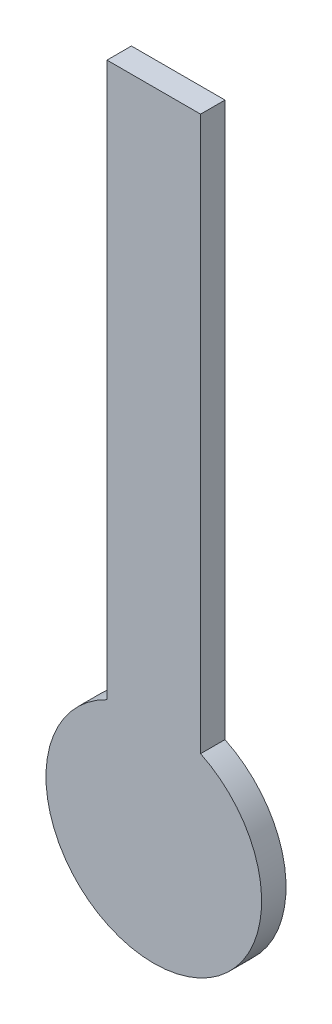
ISO-10303-21;
HEADER;
FILE_DESCRIPTION(('STEP AP214'),'2;1');
FILE_NAME('part.step','',(''),(''),'','','');
FILE_SCHEMA(('AUTOMOTIVE_DESIGN { 1 0 10303 214 1 1 1 1 }'));
ENDSEC;
DATA;
#1=APPLICATION_CONTEXT('core data for automotive mechanical design processes');
#2=APPLICATION_PROTOCOL_DEFINITION('international standard','automotive_design',2000,#1);
#3=PRODUCT_CONTEXT('',#1,'mechanical');
#4=PRODUCT('Part','Part','',(#3));
#5=PRODUCT_RELATED_PRODUCT_CATEGORY('part','',(#4));
#6=PRODUCT_DEFINITION_FORMATION('','',#4);
#7=PRODUCT_DEFINITION_CONTEXT('part definition',#1,'design');
#8=PRODUCT_DEFINITION('design','',#6,#7);
#9=PRODUCT_DEFINITION_SHAPE('','',#8);
#10=(LENGTH_UNIT() NAMED_UNIT(*) SI_UNIT(.MILLI.,.METRE.));
#11=(NAMED_UNIT(*) PLANE_ANGLE_UNIT() SI_UNIT($,.RADIAN.));
#12=(NAMED_UNIT(*) SI_UNIT($,.STERADIAN.) SOLID_ANGLE_UNIT());
#13=UNCERTAINTY_MEASURE_WITH_UNIT(LENGTH_MEASURE(1.E-05),#10,'distance_accuracy_value','');
#14=(GEOMETRIC_REPRESENTATION_CONTEXT(3) GLOBAL_UNCERTAINTY_ASSIGNED_CONTEXT((#13)) GLOBAL_UNIT_ASSIGNED_CONTEXT((#10,
#11,#12)) REPRESENTATION_CONTEXT('',''));
#15=CARTESIAN_POINT('',(0.,0.,0.));
#16=DIRECTION('',(0.,0.,1.));
#17=DIRECTION('',(1.,0.,0.));
#18=AXIS2_PLACEMENT_3D('',#15,#16,#17);
#19=CARTESIAN_POINT('',(0.,0.,3.));
#20=DIRECTION('',(0.,0.,-1.));
#21=DIRECTION('',(-1.,0.,0.));
#22=AXIS2_PLACEMENT_3D('',#19,#20,#21);
#23=CYLINDRICAL_SURFACE('',#22,13.25);
#24=CARTESIAN_POINT('',(0.,0.,0.));
#25=DIRECTION('',(0.,0.,1.));
#26=DIRECTION('',(1.,0.,0.));
#27=AXIS2_PLACEMENT_3D('',#24,#25,#26);
#28=CIRCLE('',#27,13.25);
#29=CARTESIAN_POINT('',(-5.75,11.9373363863133,0.));
#30=VERTEX_POINT('',#29);
#31=CARTESIAN_POINT('',(5.75,11.9373363863133,0.));
#32=VERTEX_POINT('',#31);
#33=EDGE_CURVE('E118',#30,#32,#28,.T.);
#34=ORIENTED_EDGE('',*,*,#33,.T.);
#35=DIRECTION('',(0.,0.,-1.));
#36=VECTOR('',#35,1.);
#37=CARTESIAN_POINT('',(5.75,11.9373363863133,3.));
#38=LINE('',#37,#36);
#39=CARTESIAN_POINT('',(5.75,11.9373363863133,3.));
#40=VERTEX_POINT('',#39);
#41=EDGE_CURVE('E12',#40,#32,#38,.T.);
#42=ORIENTED_EDGE('',*,*,#41,.F.);
#43=CARTESIAN_POINT('',(0.,0.,3.));
#44=DIRECTION('',(0.,0.,1.));
#45=DIRECTION('',(1.,0.,0.));
#46=AXIS2_PLACEMENT_3D('',#43,#44,#45);
#47=CIRCLE('',#46,13.25);
#48=CARTESIAN_POINT('',(-5.75,11.9373363863133,3.));
#49=VERTEX_POINT('',#48);
#50=EDGE_CURVE('E87',#49,#40,#47,.T.);
#51=ORIENTED_EDGE('',*,*,#50,.F.);
#52=DIRECTION('',(0.,0.,-1.));
#53=VECTOR('',#52,1.);
#54=CARTESIAN_POINT('',(-5.75,11.9373363863133,3.));
#55=LINE('',#54,#53);
#56=EDGE_CURVE('E98',#49,#30,#55,.T.);
#57=ORIENTED_EDGE('',*,*,#56,.T.);
#58=EDGE_LOOP('',(#34,#42,#51,#57));
#59=FACE_BOUND('',#58,.T.);
#60=ADVANCED_FACE('F36',(#59),#23,.T.);
#61=CARTESIAN_POINT('',(5.75,11.9373363863133,3.));
#62=DIRECTION('',(-1.,0.,0.));
#63=DIRECTION('',(0.,0.,1.));
#64=AXIS2_PLACEMENT_3D('',#61,#62,#63);
#65=PLANE('',#64);
#66=DIRECTION('',(0.,1.,0.));
#67=VECTOR('',#66,1.);
#68=CARTESIAN_POINT('',(5.75,11.9373363863133,0.));
#69=LINE('',#68,#67);
#70=CARTESIAN_POINT('',(5.75,80.,0.));
#71=VERTEX_POINT('',#70);
#72=EDGE_CURVE('E92',#32,#71,#69,.T.);
#73=ORIENTED_EDGE('',*,*,#72,.T.);
#74=DIRECTION('',(0.,0.,-1.));
#75=VECTOR('',#74,1.);
#76=CARTESIAN_POINT('',(5.75,80.,3.));
#77=LINE('',#76,#75);
#78=CARTESIAN_POINT('',(5.75,80.,3.));
#79=VERTEX_POINT('',#78);
#80=EDGE_CURVE('E44',#79,#71,#77,.T.);
#81=ORIENTED_EDGE('',*,*,#80,.F.);
#82=DIRECTION('',(0.,1.,0.));
#83=VECTOR('',#82,1.);
#84=CARTESIAN_POINT('',(5.75,11.9373363863133,3.));
#85=LINE('',#84,#83);
#86=EDGE_CURVE('E82',#40,#79,#85,.T.);
#87=ORIENTED_EDGE('',*,*,#86,.F.);
#88=ORIENTED_EDGE('',*,*,#41,.T.);
#89=EDGE_LOOP('',(#73,#81,#87,#88));
#90=FACE_BOUND('',#89,.T.);
#91=ADVANCED_FACE('F91',(#90),#65,.F.);
#92=CARTESIAN_POINT('',(-5.75,80.,3.));
#93=DIRECTION('',(0.,-1.,0.));
#94=DIRECTION('',(0.,0.,-1.));
#95=AXIS2_PLACEMENT_3D('',#92,#93,#94);
#96=PLANE('',#95);
#97=DIRECTION('',(-1.,0.,0.));
#98=VECTOR('',#97,1.);
#99=CARTESIAN_POINT('',(-5.75,80.,0.));
#100=LINE('',#99,#98);
#101=CARTESIAN_POINT('',(-5.75,80.,0.));
#102=VERTEX_POINT('',#101);
#103=EDGE_CURVE('E69',#71,#102,#100,.T.);
#104=ORIENTED_EDGE('',*,*,#103,.T.);
#105=DIRECTION('',(0.,0.,-1.));
#106=VECTOR('',#105,1.);
#107=CARTESIAN_POINT('',(-5.75,80.,3.));
#108=LINE('',#107,#106);
#109=CARTESIAN_POINT('',(-5.75,80.,3.));
#110=VERTEX_POINT('',#109);
#111=EDGE_CURVE('E93',#110,#102,#108,.T.);
#112=ORIENTED_EDGE('',*,*,#111,.F.);
#113=DIRECTION('',(-1.,0.,0.));
#114=VECTOR('',#113,1.);
#115=CARTESIAN_POINT('',(-5.75,80.,3.));
#116=LINE('',#115,#114);
#117=EDGE_CURVE('E85',#79,#110,#116,.T.);
#118=ORIENTED_EDGE('',*,*,#117,.F.);
#119=ORIENTED_EDGE('',*,*,#80,.T.);
#120=EDGE_LOOP('',(#104,#112,#118,#119));
#121=FACE_BOUND('',#120,.T.);
#122=ADVANCED_FACE('F94',(#121),#96,.F.);
#123=CARTESIAN_POINT('',(-5.75,11.9373363863133,3.));
#124=DIRECTION('',(1.,0.,0.));
#125=DIRECTION('',(0.,0.,-1.));
#126=AXIS2_PLACEMENT_3D('',#123,#124,#125);
#127=PLANE('',#126);
#128=DIRECTION('',(0.,-1.,0.));
#129=VECTOR('',#128,1.);
#130=CARTESIAN_POINT('',(-5.75,11.9373363863133,0.));
#131=LINE('',#130,#129);
#132=EDGE_CURVE('E75',#102,#30,#131,.T.);
#133=ORIENTED_EDGE('',*,*,#132,.T.);
#134=ORIENTED_EDGE('',*,*,#56,.F.);
#135=DIRECTION('',(0.,-1.,0.));
#136=VECTOR('',#135,1.);
#137=CARTESIAN_POINT('',(-5.75,11.9373363863133,3.));
#138=LINE('',#137,#136);
#139=EDGE_CURVE('E52',#110,#49,#138,.T.);
#140=ORIENTED_EDGE('',*,*,#139,.F.);
#141=ORIENTED_EDGE('',*,*,#111,.T.);
#142=EDGE_LOOP('',(#133,#134,#140,#141));
#143=FACE_BOUND('',#142,.T.);
#144=ADVANCED_FACE('F113',(#143),#127,.F.);
#145=CARTESIAN_POINT('',(0.,0.,3.));
#146=DIRECTION('',(0.,0.,1.));
#147=DIRECTION('',(1.,0.,0.));
#148=AXIS2_PLACEMENT_3D('',#145,#146,#147);
#149=PLANE('',#148);
#150=ORIENTED_EDGE('',*,*,#50,.T.);
#151=ORIENTED_EDGE('',*,*,#86,.T.);
#152=ORIENTED_EDGE('',*,*,#117,.T.);
#153=ORIENTED_EDGE('',*,*,#139,.T.);
#154=EDGE_LOOP('',(#150,#151,#152,#153));
#155=FACE_BOUND('',#154,.T.);
#156=ADVANCED_FACE('F83',(#155),#149,.T.);
#157=CARTESIAN_POINT('',(0.,0.,0.));
#158=DIRECTION('',(0.,0.,1.));
#159=DIRECTION('',(1.,0.,0.));
#160=AXIS2_PLACEMENT_3D('',#157,#158,#159);
#161=PLANE('',#160);
#162=ORIENTED_EDGE('',*,*,#33,.F.);
#163=ORIENTED_EDGE('',*,*,#132,.F.);
#164=ORIENTED_EDGE('',*,*,#103,.F.);
#165=ORIENTED_EDGE('',*,*,#72,.F.);
#166=EDGE_LOOP('',(#162,#163,#164,#165));
#167=FACE_BOUND('',#166,.T.);
#168=ADVANCED_FACE('F116',(#167),#161,.F.);
#169=CLOSED_SHELL('',(#60,#91,#122,#144,#156,#168));
#170=MANIFOLD_SOLID_BREP('B2',#169);
#171=ADVANCED_BREP_SHAPE_REPRESENTATION('',(#18,#170),#14);
#172=SHAPE_DEFINITION_REPRESENTATION(#9,#171);
ENDSEC;
END-ISO-10303-21;
